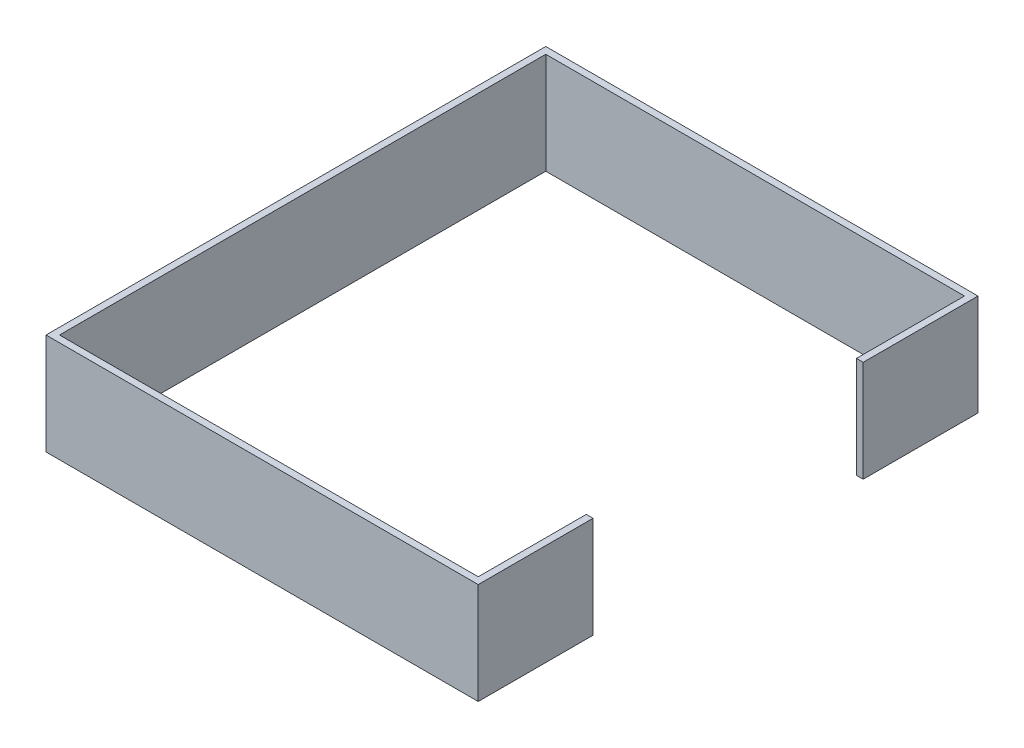
ISO-10303-21;
HEADER;
FILE_DESCRIPTION(('STEP AP214'),'2;1');
FILE_NAME('part.step','',(''),(''),'','','');
FILE_SCHEMA(('AUTOMOTIVE_DESIGN { 1 0 10303 214 1 1 1 1 }'));
ENDSEC;
DATA;
#1=APPLICATION_CONTEXT('core data for automotive mechanical design processes');
#2=APPLICATION_PROTOCOL_DEFINITION('international standard','automotive_design',2000,#1);
#3=PRODUCT_CONTEXT('',#1,'mechanical');
#4=PRODUCT('Part','Part','',(#3));
#5=PRODUCT_RELATED_PRODUCT_CATEGORY('part','',(#4));
#6=PRODUCT_DEFINITION_FORMATION('','',#4);
#7=PRODUCT_DEFINITION_CONTEXT('part definition',#1,'design');
#8=PRODUCT_DEFINITION('design','',#6,#7);
#9=PRODUCT_DEFINITION_SHAPE('','',#8);
#10=(LENGTH_UNIT() NAMED_UNIT(*) SI_UNIT(.MILLI.,.METRE.));
#11=(NAMED_UNIT(*) PLANE_ANGLE_UNIT() SI_UNIT($,.RADIAN.));
#12=(NAMED_UNIT(*) SI_UNIT($,.STERADIAN.) SOLID_ANGLE_UNIT());
#13=UNCERTAINTY_MEASURE_WITH_UNIT(LENGTH_MEASURE(1.E-05),#10,'distance_accuracy_value','');
#14=(GEOMETRIC_REPRESENTATION_CONTEXT(3) GLOBAL_UNCERTAINTY_ASSIGNED_CONTEXT((#13)) GLOBAL_UNIT_ASSIGNED_CONTEXT((#10,
#11,#12)) REPRESENTATION_CONTEXT('',''));
#15=CARTESIAN_POINT('',(0.,0.,0.));
#16=DIRECTION('',(0.,0.,1.));
#17=DIRECTION('',(1.,0.,0.));
#18=AXIS2_PLACEMENT_3D('',#15,#16,#17);
#19=CARTESIAN_POINT('',(441.943070464428,1138.59608296994,-471.994417004189));
#20=DIRECTION('',(-1.,0.,0.));
#21=DIRECTION('',(0.,0.,1.));
#22=AXIS2_PLACEMENT_3D('',#19,#20,#21);
#23=PLANE('',#22);
#24=DIRECTION('',(0.,0.,-1.));
#25=VECTOR('',#24,1.);
#26=CARTESIAN_POINT('',(441.943070464428,1298.59608296994,236.005582995811));
#27=LINE('',#26,#25);
#28=CARTESIAN_POINT('',(441.943070464428,1298.59608296994,-333.99441700419));
#29=VERTEX_POINT('',#28);
#30=CARTESIAN_POINT('',(441.943070464428,1298.59608296994,-503.994417004189));
#31=VERTEX_POINT('',#30);
#32=EDGE_CURVE('E182',#29,#31,#27,.T.);
#33=ORIENTED_EDGE('',*,*,#32,.F.);
#34=DIRECTION('',(0.,1.,0.));
#35=VECTOR('',#34,1.);
#36=CARTESIAN_POINT('',(441.943070464428,1148.59608296994,-333.99441700419));
#37=LINE('',#36,#35);
#38=CARTESIAN_POINT('',(441.943070464428,1148.59608296994,-333.99441700419));
#39=VERTEX_POINT('',#38);
#40=EDGE_CURVE('E136',#39,#29,#37,.T.);
#41=ORIENTED_EDGE('',*,*,#40,.F.);
#42=DIRECTION('',(0.,0.,1.));
#43=VECTOR('',#42,1.);
#44=CARTESIAN_POINT('',(441.943070464428,1148.59608296994,236.005582995811));
#45=LINE('',#44,#43);
#46=CARTESIAN_POINT('',(441.943070464428,1148.59608296994,-503.994417004189));
#47=VERTEX_POINT('',#46);
#48=EDGE_CURVE('E154',#47,#39,#45,.T.);
#49=ORIENTED_EDGE('',*,*,#48,.F.);
#50=DIRECTION('',(0.,-1.,0.));
#51=VECTOR('',#50,1.);
#52=CARTESIAN_POINT('',(441.943070464428,1148.59608296994,-503.994417004189));
#53=LINE('',#52,#51);
#54=EDGE_CURVE('E155',#31,#47,#53,.T.);
#55=ORIENTED_EDGE('',*,*,#54,.F.);
#56=EDGE_LOOP('',(#33,#41,#49,#55));
#57=FACE_BOUND('',#56,.T.);
#58=ADVANCED_FACE('F41',(#57),#23,.F.);
#59=CARTESIAN_POINT('',(431.943070464428,198.438201352365,226.005582995811));
#60=DIRECTION('',(1.,0.,0.));
#61=DIRECTION('',(0.,0.,-1.));
#62=AXIS2_PLACEMENT_3D('',#59,#60,#61);
#63=PLANE('',#62);
#64=DIRECTION('',(0.,0.,1.));
#65=VECTOR('',#64,1.);
#66=CARTESIAN_POINT('',(431.943070464428,1148.59608296994,226.005582995811));
#67=LINE('',#66,#65);
#68=CARTESIAN_POINT('',(431.943070464428,1148.59608296994,-493.994417004189));
#69=VERTEX_POINT('',#68);
#70=CARTESIAN_POINT('',(431.943070464428,1148.59608296994,-333.99441700419));
#71=VERTEX_POINT('',#70);
#72=EDGE_CURVE('E207',#69,#71,#67,.T.);
#73=ORIENTED_EDGE('',*,*,#72,.T.);
#74=DIRECTION('',(0.,1.,0.));
#75=VECTOR('',#74,1.);
#76=CARTESIAN_POINT('',(431.943070464428,198.438201352365,-333.99441700419));
#77=LINE('',#76,#75);
#78=CARTESIAN_POINT('',(431.943070464428,1298.59608296994,-333.994417004189));
#79=VERTEX_POINT('',#78);
#80=EDGE_CURVE('E11',#71,#79,#77,.T.);
#81=ORIENTED_EDGE('',*,*,#80,.T.);
#82=DIRECTION('',(0.,0.,-1.));
#83=VECTOR('',#82,1.);
#84=CARTESIAN_POINT('',(431.943070464428,1298.59608296994,226.005582995811));
#85=LINE('',#84,#83);
#86=CARTESIAN_POINT('',(431.943070464428,1298.59608296994,-493.994417004189));
#87=VERTEX_POINT('',#86);
#88=EDGE_CURVE('E224',#79,#87,#85,.T.);
#89=ORIENTED_EDGE('',*,*,#88,.T.);
#90=DIRECTION('',(0.,1.,0.));
#91=VECTOR('',#90,1.);
#92=CARTESIAN_POINT('',(431.943070464428,198.438201352365,-493.994417004189));
#93=LINE('',#92,#91);
#94=EDGE_CURVE('E235',#69,#87,#93,.T.);
#95=ORIENTED_EDGE('',*,*,#94,.F.);
#96=EDGE_LOOP('',(#73,#81,#89,#95));
#97=FACE_BOUND('',#96,.T.);
#98=ADVANCED_FACE('F305',(#97),#63,.F.);
#99=CARTESIAN_POINT('',(1196.99273770494,1298.59608296994,236.005582995811));
#100=DIRECTION('',(0.,-1.,0.));
#101=DIRECTION('',(0.,0.,-1.));
#102=AXIS2_PLACEMENT_3D('',#99,#100,#101);
#103=PLANE('',#102);
#104=ORIENTED_EDGE('',*,*,#88,.F.);
#105=DIRECTION('',(1.,0.,0.));
#106=VECTOR('',#105,1.);
#107=CARTESIAN_POINT('',(-615.257116801449,1298.59608296994,-333.99441700419));
#108=LINE('',#107,#106);
#109=EDGE_CURVE('E57',#79,#29,#108,.T.);
#110=ORIENTED_EDGE('',*,*,#109,.T.);
#111=ORIENTED_EDGE('',*,*,#32,.T.);
#112=DIRECTION('',(-1.,0.,0.));
#113=VECTOR('',#112,1.);
#114=CARTESIAN_POINT('',(1196.99273770494,1298.59608296994,-503.994417004189));
#115=LINE('',#114,#113);
#116=CARTESIAN_POINT('',(-198.056929535572,1298.59608296994,-503.994417004189));
#117=VERTEX_POINT('',#116);
#118=EDGE_CURVE('E172',#31,#117,#115,.T.);
#119=ORIENTED_EDGE('',*,*,#118,.T.);
#120=DIRECTION('',(0.,0.,-1.));
#121=VECTOR('',#120,1.);
#122=CARTESIAN_POINT('',(-198.056929535572,1298.59608296994,236.005582995811));
#123=LINE('',#122,#121);
#124=CARTESIAN_POINT('',(-198.056929535572,1298.59608296994,236.005582995811));
#125=VERTEX_POINT('',#124);
#126=EDGE_CURVE('E251',#125,#117,#123,.T.);
#127=ORIENTED_EDGE('',*,*,#126,.F.);
#128=DIRECTION('',(-1.,0.,0.));
#129=VECTOR('',#128,1.);
#130=CARTESIAN_POINT('',(1196.99273770494,1298.59608296994,236.005582995811));
#131=LINE('',#130,#129);
#132=CARTESIAN_POINT('',(441.943070464428,1298.59608296994,236.005582995811));
#133=VERTEX_POINT('',#132);
#134=EDGE_CURVE('E169',#133,#125,#131,.T.);
#135=ORIENTED_EDGE('',*,*,#134,.F.);
#136=CARTESIAN_POINT('',(441.943070464428,1298.59608296994,66.0055829958105));
#137=VERTEX_POINT('',#136);
#138=EDGE_CURVE('E163',#133,#137,#27,.T.);
#139=ORIENTED_EDGE('',*,*,#138,.T.);
#140=DIRECTION('',(1.,0.,0.));
#141=VECTOR('',#140,1.);
#142=CARTESIAN_POINT('',(-615.257116801449,1298.59608296994,66.0055829958105));
#143=LINE('',#142,#141);
#144=CARTESIAN_POINT('',(431.943070464428,1298.59608296994,66.0055829958105));
#145=VERTEX_POINT('',#144);
#146=EDGE_CURVE('E131',#145,#137,#143,.T.);
#147=ORIENTED_EDGE('',*,*,#146,.F.);
#148=CARTESIAN_POINT('',(431.943070464428,1298.59608296994,226.005582995811));
#149=VERTEX_POINT('',#148);
#150=EDGE_CURVE('E192',#149,#145,#85,.T.);
#151=ORIENTED_EDGE('',*,*,#150,.F.);
#152=DIRECTION('',(1.,0.,0.));
#153=VECTOR('',#152,1.);
#154=CARTESIAN_POINT('',(431.943070464428,1298.59608296994,226.005582995811));
#155=LINE('',#154,#153);
#156=CARTESIAN_POINT('',(-188.056929535572,1298.59608296994,226.005582995811));
#157=VERTEX_POINT('',#156);
#158=EDGE_CURVE('E220',#157,#149,#155,.T.);
#159=ORIENTED_EDGE('',*,*,#158,.F.);
#160=DIRECTION('',(0.,0.,1.));
#161=VECTOR('',#160,1.);
#162=CARTESIAN_POINT('',(-188.056929535572,1298.59608296994,226.005582995811));
#163=LINE('',#162,#161);
#164=CARTESIAN_POINT('',(-188.056929535572,1298.59608296994,-493.994417004189));
#165=VERTEX_POINT('',#164);
#166=EDGE_CURVE('E147',#165,#157,#163,.T.);
#167=ORIENTED_EDGE('',*,*,#166,.F.);
#168=DIRECTION('',(-1.,0.,0.));
#169=VECTOR('',#168,1.);
#170=CARTESIAN_POINT('',(431.943070464428,1298.59608296994,-493.994417004189));
#171=LINE('',#170,#169);
#172=EDGE_CURVE('E227',#87,#165,#171,.T.);
#173=ORIENTED_EDGE('',*,*,#172,.F.);
#174=EDGE_LOOP('',(#104,#110,#111,#119,#127,#135,#139,#147,#151,#159,#167,#173));
#175=FACE_BOUND('',#174,.T.);
#176=ADVANCED_FACE('F195',(#175),#103,.F.);
#177=CARTESIAN_POINT('',(1196.99273770494,1148.59608296994,-503.994417004189));
#178=DIRECTION('',(0.,0.,1.));
#179=DIRECTION('',(1.,0.,0.));
#180=AXIS2_PLACEMENT_3D('',#177,#178,#179);
#181=PLANE('',#180);
#182=ORIENTED_EDGE('',*,*,#118,.F.);
#183=ORIENTED_EDGE('',*,*,#54,.T.);
#184=DIRECTION('',(-1.,0.,0.));
#185=VECTOR('',#184,1.);
#186=CARTESIAN_POINT('',(1196.99273770494,1148.59608296994,-503.994417004189));
#187=LINE('',#186,#185);
#188=CARTESIAN_POINT('',(-198.056929535572,1148.59608296994,-503.994417004189));
#189=VERTEX_POINT('',#188);
#190=EDGE_CURVE('E176',#47,#189,#187,.T.);
#191=ORIENTED_EDGE('',*,*,#190,.T.);
#192=DIRECTION('',(0.,-1.,0.));
#193=VECTOR('',#192,1.);
#194=CARTESIAN_POINT('',(-198.056929535572,1148.59608296994,-503.994417004189));
#195=LINE('',#194,#193);
#196=EDGE_CURVE('E247',#117,#189,#195,.T.);
#197=ORIENTED_EDGE('',*,*,#196,.F.);
#198=EDGE_LOOP('',(#182,#183,#191,#197));
#199=FACE_BOUND('',#198,.T.);
#200=ADVANCED_FACE('F271',(#199),#181,.F.);
#201=CARTESIAN_POINT('',(1196.99273770494,1148.59608296994,236.005582995811));
#202=DIRECTION('',(0.,1.,0.));
#203=DIRECTION('',(0.,0.,1.));
#204=AXIS2_PLACEMENT_3D('',#201,#202,#203);
#205=PLANE('',#204);
#206=ORIENTED_EDGE('',*,*,#48,.T.);
#207=DIRECTION('',(1.,0.,0.));
#208=VECTOR('',#207,1.);
#209=CARTESIAN_POINT('',(-615.257116801449,1148.59608296994,-333.99441700419));
#210=LINE('',#209,#208);
#211=EDGE_CURVE('E202',#71,#39,#210,.T.);
#212=ORIENTED_EDGE('',*,*,#211,.F.);
#213=ORIENTED_EDGE('',*,*,#72,.F.);
#214=DIRECTION('',(1.,0.,0.));
#215=VECTOR('',#214,1.);
#216=CARTESIAN_POINT('',(431.943070464428,1148.59608296994,-493.994417004189));
#217=LINE('',#216,#215);
#218=CARTESIAN_POINT('',(-188.056929535572,1148.59608296994,-493.994417004189));
#219=VERTEX_POINT('',#218);
#220=EDGE_CURVE('E211',#219,#69,#217,.T.);
#221=ORIENTED_EDGE('',*,*,#220,.F.);
#222=DIRECTION('',(0.,0.,-1.));
#223=VECTOR('',#222,1.);
#224=CARTESIAN_POINT('',(-188.056929535572,1148.59608296994,226.005582995811));
#225=LINE('',#224,#223);
#226=CARTESIAN_POINT('',(-188.056929535572,1148.59608296994,226.005582995811));
#227=VERTEX_POINT('',#226);
#228=EDGE_CURVE('E214',#227,#219,#225,.T.);
#229=ORIENTED_EDGE('',*,*,#228,.F.);
#230=DIRECTION('',(-1.,0.,0.));
#231=VECTOR('',#230,1.);
#232=CARTESIAN_POINT('',(431.943070464428,1148.59608296994,226.005582995811));
#233=LINE('',#232,#231);
#234=CARTESIAN_POINT('',(431.943070464428,1148.59608296994,226.005582995811));
#235=VERTEX_POINT('',#234);
#236=EDGE_CURVE('E217',#235,#227,#233,.T.);
#237=ORIENTED_EDGE('',*,*,#236,.F.);
#238=CARTESIAN_POINT('',(431.943070464428,1148.59608296994,66.0055829958104));
#239=VERTEX_POINT('',#238);
#240=EDGE_CURVE('E145',#239,#235,#67,.T.);
#241=ORIENTED_EDGE('',*,*,#240,.F.);
#242=DIRECTION('',(1.,0.,0.));
#243=VECTOR('',#242,1.);
#244=CARTESIAN_POINT('',(-615.257116801449,1148.59608296994,66.0055829958104));
#245=LINE('',#244,#243);
#246=CARTESIAN_POINT('',(441.943070464428,1148.59608296994,66.0055829958104));
#247=VERTEX_POINT('',#246);
#248=EDGE_CURVE('E64',#239,#247,#245,.T.);
#249=ORIENTED_EDGE('',*,*,#248,.T.);
#250=CARTESIAN_POINT('',(441.943070464428,1148.59608296994,236.005582995811));
#251=VERTEX_POINT('',#250);
#252=EDGE_CURVE('E142',#247,#251,#45,.T.);
#253=ORIENTED_EDGE('',*,*,#252,.T.);
#254=DIRECTION('',(-1.,0.,0.));
#255=VECTOR('',#254,1.);
#256=CARTESIAN_POINT('',(1196.99273770494,1148.59608296994,236.005582995811));
#257=LINE('',#256,#255);
#258=CARTESIAN_POINT('',(-198.056929535572,1148.59608296994,236.005582995811));
#259=VERTEX_POINT('',#258);
#260=EDGE_CURVE('E179',#251,#259,#257,.T.);
#261=ORIENTED_EDGE('',*,*,#260,.T.);
#262=DIRECTION('',(0.,0.,1.));
#263=VECTOR('',#262,1.);
#264=CARTESIAN_POINT('',(-198.056929535572,1148.59608296994,236.005582995811));
#265=LINE('',#264,#263);
#266=EDGE_CURVE('E173',#189,#259,#265,.T.);
#267=ORIENTED_EDGE('',*,*,#266,.F.);
#268=ORIENTED_EDGE('',*,*,#190,.F.);
#269=EDGE_LOOP('',(#206,#212,#213,#221,#229,#237,#241,#249,#253,#261,#267,#268));
#270=FACE_BOUND('',#269,.T.);
#271=ADVANCED_FACE('F141',(#270),#205,.F.);
#272=CARTESIAN_POINT('',(1196.99273770494,1148.59608296994,236.005582995811));
#273=DIRECTION('',(0.,0.,-1.));
#274=DIRECTION('',(-1.,0.,0.));
#275=AXIS2_PLACEMENT_3D('',#272,#273,#274);
#276=PLANE('',#275);
#277=ORIENTED_EDGE('',*,*,#260,.F.);
#278=DIRECTION('',(0.,1.,0.));
#279=VECTOR('',#278,1.);
#280=CARTESIAN_POINT('',(441.943070464428,1148.59608296994,236.005582995811));
#281=LINE('',#280,#279);
#282=EDGE_CURVE('E151',#251,#133,#281,.T.);
#283=ORIENTED_EDGE('',*,*,#282,.T.);
#284=ORIENTED_EDGE('',*,*,#134,.T.);
#285=DIRECTION('',(0.,1.,0.));
#286=VECTOR('',#285,1.);
#287=CARTESIAN_POINT('',(-198.056929535572,1148.59608296994,236.005582995811));
#288=LINE('',#287,#286);
#289=EDGE_CURVE('E255',#259,#125,#288,.T.);
#290=ORIENTED_EDGE('',*,*,#289,.F.);
#291=EDGE_LOOP('',(#277,#283,#284,#290));
#292=FACE_BOUND('',#291,.T.);
#293=ADVANCED_FACE('F43',(#292),#276,.F.);
#294=ORIENTED_EDGE('',*,*,#252,.F.);
#295=DIRECTION('',(0.,-1.,0.));
#296=VECTOR('',#295,1.);
#297=CARTESIAN_POINT('',(441.943070464428,1298.59608296994,66.0055829958105));
#298=LINE('',#297,#296);
#299=EDGE_CURVE('E128',#137,#247,#298,.T.);
#300=ORIENTED_EDGE('',*,*,#299,.F.);
#301=ORIENTED_EDGE('',*,*,#138,.F.);
#302=ORIENTED_EDGE('',*,*,#282,.F.);
#303=EDGE_LOOP('',(#294,#300,#301,#302));
#304=FACE_BOUND('',#303,.T.);
#305=ADVANCED_FACE('F149',(#304),#23,.F.);
#306=CARTESIAN_POINT('',(-198.056929535572,1138.59608296994,-471.994417004189));
#307=DIRECTION('',(1.,0.,0.));
#308=DIRECTION('',(0.,0.,-1.));
#309=AXIS2_PLACEMENT_3D('',#306,#307,#308);
#310=PLANE('',#309);
#311=ORIENTED_EDGE('',*,*,#289,.T.);
#312=ORIENTED_EDGE('',*,*,#126,.T.);
#313=ORIENTED_EDGE('',*,*,#196,.T.);
#314=ORIENTED_EDGE('',*,*,#266,.T.);
#315=EDGE_LOOP('',(#311,#312,#313,#314));
#316=FACE_BOUND('',#315,.T.);
#317=ADVANCED_FACE('F264',(#316),#310,.F.);
#318=CARTESIAN_POINT('',(-188.056929535572,198.438201352365,226.005582995811));
#319=DIRECTION('',(-1.,0.,0.));
#320=DIRECTION('',(0.,0.,1.));
#321=AXIS2_PLACEMENT_3D('',#318,#319,#320);
#322=PLANE('',#321);
#323=ORIENTED_EDGE('',*,*,#228,.T.);
#324=DIRECTION('',(0.,1.,0.));
#325=VECTOR('',#324,1.);
#326=CARTESIAN_POINT('',(-188.056929535572,198.438201352365,-493.994417004189));
#327=LINE('',#326,#325);
#328=EDGE_CURVE('E232',#219,#165,#327,.T.);
#329=ORIENTED_EDGE('',*,*,#328,.T.);
#330=ORIENTED_EDGE('',*,*,#166,.T.);
#331=DIRECTION('',(0.,1.,0.));
#332=VECTOR('',#331,1.);
#333=CARTESIAN_POINT('',(-188.056929535572,198.438201352365,226.005582995811));
#334=LINE('',#333,#332);
#335=EDGE_CURVE('E231',#227,#157,#334,.T.);
#336=ORIENTED_EDGE('',*,*,#335,.F.);
#337=EDGE_LOOP('',(#323,#329,#330,#336));
#338=FACE_BOUND('',#337,.T.);
#339=ADVANCED_FACE('F313',(#338),#322,.F.);
#340=CARTESIAN_POINT('',(431.943070464428,198.438201352365,-493.994417004189));
#341=DIRECTION('',(0.,0.,-1.));
#342=DIRECTION('',(-1.,0.,0.));
#343=AXIS2_PLACEMENT_3D('',#340,#341,#342);
#344=PLANE('',#343);
#345=ORIENTED_EDGE('',*,*,#220,.T.);
#346=ORIENTED_EDGE('',*,*,#94,.T.);
#347=ORIENTED_EDGE('',*,*,#172,.T.);
#348=ORIENTED_EDGE('',*,*,#328,.F.);
#349=EDGE_LOOP('',(#345,#346,#347,#348));
#350=FACE_BOUND('',#349,.T.);
#351=ADVANCED_FACE('F307',(#350),#344,.F.);
#352=ORIENTED_EDGE('',*,*,#150,.T.);
#353=DIRECTION('',(0.,-1.,0.));
#354=VECTOR('',#353,1.);
#355=CARTESIAN_POINT('',(431.943070464428,198.438201352365,66.0055829958103));
#356=LINE('',#355,#354);
#357=EDGE_CURVE('E50',#145,#239,#356,.T.);
#358=ORIENTED_EDGE('',*,*,#357,.T.);
#359=ORIENTED_EDGE('',*,*,#240,.T.);
#360=DIRECTION('',(0.,1.,0.));
#361=VECTOR('',#360,1.);
#362=CARTESIAN_POINT('',(431.943070464428,198.438201352365,226.005582995811));
#363=LINE('',#362,#361);
#364=EDGE_CURVE('E239',#235,#149,#363,.T.);
#365=ORIENTED_EDGE('',*,*,#364,.T.);
#366=EDGE_LOOP('',(#352,#358,#359,#365));
#367=FACE_BOUND('',#366,.T.);
#368=ADVANCED_FACE('F189',(#367),#63,.F.);
#369=CARTESIAN_POINT('',(431.943070464428,198.438201352365,226.005582995811));
#370=DIRECTION('',(0.,0.,1.));
#371=DIRECTION('',(1.,0.,0.));
#372=AXIS2_PLACEMENT_3D('',#369,#370,#371);
#373=PLANE('',#372);
#374=ORIENTED_EDGE('',*,*,#236,.T.);
#375=ORIENTED_EDGE('',*,*,#335,.T.);
#376=ORIENTED_EDGE('',*,*,#158,.T.);
#377=ORIENTED_EDGE('',*,*,#364,.F.);
#378=EDGE_LOOP('',(#374,#375,#376,#377));
#379=FACE_BOUND('',#378,.T.);
#380=ADVANCED_FACE('F315',(#379),#373,.F.);
#381=CARTESIAN_POINT('',(-615.257116801449,1298.59608296994,66.0055829958105));
#382=DIRECTION('',(0.,0.,1.));
#383=DIRECTION('',(0.,-1.,0.));
#384=AXIS2_PLACEMENT_3D('',#381,#382,#383);
#385=PLANE('',#384);
#386=ORIENTED_EDGE('',*,*,#146,.T.);
#387=ORIENTED_EDGE('',*,*,#299,.T.);
#388=ORIENTED_EDGE('',*,*,#248,.F.);
#389=ORIENTED_EDGE('',*,*,#357,.F.);
#390=EDGE_LOOP('',(#386,#387,#388,#389));
#391=FACE_BOUND('',#390,.T.);
#392=ADVANCED_FACE('F129',(#391),#385,.F.);
#393=CARTESIAN_POINT('',(-615.257116801449,1148.59608296994,-333.99441700419));
#394=DIRECTION('',(0.,0.,-1.));
#395=DIRECTION('',(-1.,0.,0.));
#396=AXIS2_PLACEMENT_3D('',#393,#394,#395);
#397=PLANE('',#396);
#398=ORIENTED_EDGE('',*,*,#211,.T.);
#399=ORIENTED_EDGE('',*,*,#40,.T.);
#400=ORIENTED_EDGE('',*,*,#109,.F.);
#401=ORIENTED_EDGE('',*,*,#80,.F.);
#402=EDGE_LOOP('',(#398,#399,#400,#401));
#403=FACE_BOUND('',#402,.T.);
#404=ADVANCED_FACE('F283',(#403),#397,.F.);
#405=CLOSED_SHELL('',(#58,#98,#176,#200,#271,#293,#305,#317,#339,#351,#368,#380,#392,#404));
#406=MANIFOLD_SOLID_BREP('B2',#405);
#407=ADVANCED_BREP_SHAPE_REPRESENTATION('',(#18,#406),#14);
#408=SHAPE_DEFINITION_REPRESENTATION(#9,#407);
ENDSEC;
END-ISO-10303-21;
